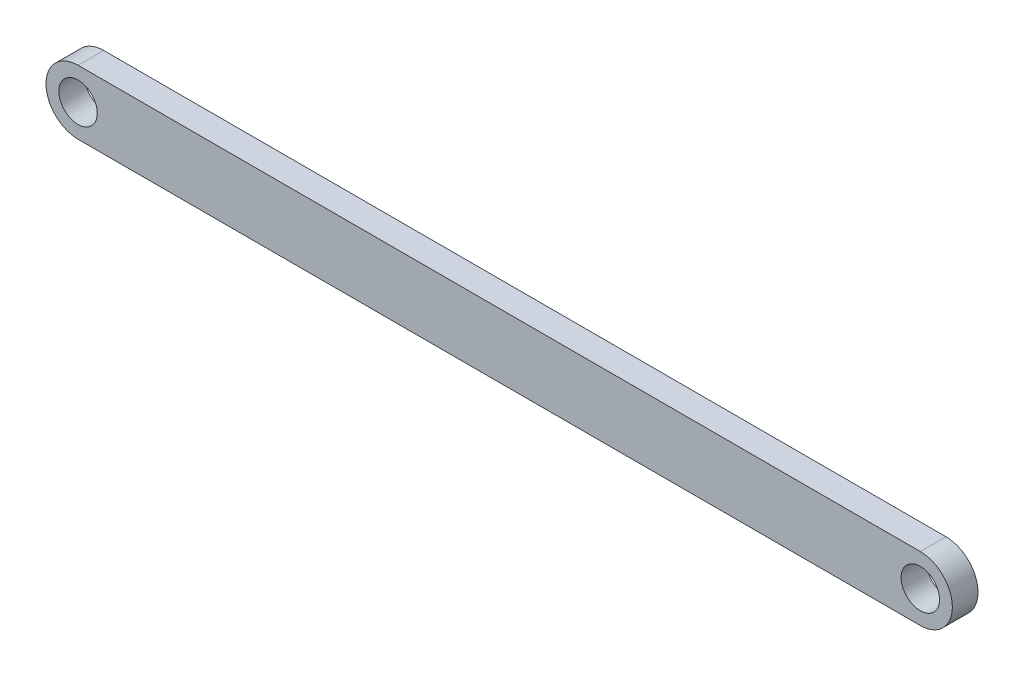
ISO-10303-21;
HEADER;
FILE_DESCRIPTION(('STEP AP214'),'2;1');
FILE_NAME('part.step','',(''),(''),'','','');
FILE_SCHEMA(('AUTOMOTIVE_DESIGN { 1 0 10303 214 1 1 1 1 }'));
ENDSEC;
DATA;
#1=APPLICATION_CONTEXT('core data for automotive mechanical design processes');
#2=APPLICATION_PROTOCOL_DEFINITION('international standard','automotive_design',2000,#1);
#3=PRODUCT_CONTEXT('',#1,'mechanical');
#4=PRODUCT('Part','Part','',(#3));
#5=PRODUCT_RELATED_PRODUCT_CATEGORY('part','',(#4));
#6=PRODUCT_DEFINITION_FORMATION('','',#4);
#7=PRODUCT_DEFINITION_CONTEXT('part definition',#1,'design');
#8=PRODUCT_DEFINITION('design','',#6,#7);
#9=PRODUCT_DEFINITION_SHAPE('','',#8);
#10=(LENGTH_UNIT() NAMED_UNIT(*) SI_UNIT(.MILLI.,.METRE.));
#11=(NAMED_UNIT(*) PLANE_ANGLE_UNIT() SI_UNIT($,.RADIAN.));
#12=(NAMED_UNIT(*) SI_UNIT($,.STERADIAN.) SOLID_ANGLE_UNIT());
#13=UNCERTAINTY_MEASURE_WITH_UNIT(LENGTH_MEASURE(1.E-05),#10,'distance_accuracy_value','');
#14=(GEOMETRIC_REPRESENTATION_CONTEXT(3) GLOBAL_UNCERTAINTY_ASSIGNED_CONTEXT((#13)) GLOBAL_UNIT_ASSIGNED_CONTEXT((#10,
#11,#12)) REPRESENTATION_CONTEXT('',''));
#15=CARTESIAN_POINT('',(0.,0.,0.));
#16=DIRECTION('',(0.,0.,1.));
#17=DIRECTION('',(1.,0.,0.));
#18=AXIS2_PLACEMENT_3D('',#15,#16,#17);
#19=CARTESIAN_POINT('',(0.0944620127087487,-0.00831713435401997,2.));
#20=DIRECTION('',(0.,0.,1.));
#21=DIRECTION('',(1.,0.,0.));
#22=AXIS2_PLACEMENT_3D('',#19,#20,#21);
#23=PLANE('',#22);
#24=CARTESIAN_POINT('',(0.0944620127087487,-0.00831713435401997,2.));
#25=DIRECTION('',(0.,0.,1.));
#26=DIRECTION('',(1.,0.,0.));
#27=AXIS2_PLACEMENT_3D('',#24,#25,#26);
#28=CIRCLE('',#27,1.5);
#29=CARTESIAN_POINT('',(1.59446201270875,-0.00831713435401997,2.));
#30=VERTEX_POINT('',#29);
#31=EDGE_CURVE('E99',#30,#30,#28,.T.);
#32=ORIENTED_EDGE('',*,*,#31,.F.);
#33=EDGE_LOOP('',(#32));
#34=FACE_BOUND('',#33,.T.);
#35=CARTESIAN_POINT('',(0.0944620127087487,-0.00831713435401997,2.));
#36=DIRECTION('',(0.,0.,1.));
#37=DIRECTION('',(1.,0.,0.));
#38=AXIS2_PLACEMENT_3D('',#35,#36,#37);
#39=CIRCLE('',#38,2.5);
#40=CARTESIAN_POINT('',(0.0944620127087487,2.49168286564598,2.));
#41=VERTEX_POINT('',#40);
#42=CARTESIAN_POINT('',(0.0944620127087487,-2.50831713435402,2.));
#43=VERTEX_POINT('',#42);
#44=EDGE_CURVE('E84',#41,#43,#39,.T.);
#45=ORIENTED_EDGE('',*,*,#44,.T.);
#46=DIRECTION('',(1.,0.,0.));
#47=VECTOR('',#46,1.);
#48=CARTESIAN_POINT('',(0.0944620127087487,-2.50831713435402,2.));
#49=LINE('',#48,#47);
#50=CARTESIAN_POINT('',(65.7944620127088,-2.50831713435402,2.));
#51=VERTEX_POINT('',#50);
#52=EDGE_CURVE('E79',#43,#51,#49,.T.);
#53=ORIENTED_EDGE('',*,*,#52,.T.);
#54=CARTESIAN_POINT('',(65.7944620127088,-0.00831713435401997,2.));
#55=DIRECTION('',(0.,0.,1.));
#56=DIRECTION('',(1.,0.,0.));
#57=AXIS2_PLACEMENT_3D('',#54,#55,#56);
#58=CIRCLE('',#57,2.5);
#59=CARTESIAN_POINT('',(65.7944620127088,2.49168286564598,2.));
#60=VERTEX_POINT('',#59);
#61=EDGE_CURVE('E82',#51,#60,#58,.T.);
#62=ORIENTED_EDGE('',*,*,#61,.T.);
#63=DIRECTION('',(-1.,0.,0.));
#64=VECTOR('',#63,1.);
#65=CARTESIAN_POINT('',(0.0944620127087487,2.49168286564598,2.));
#66=LINE('',#65,#64);
#67=EDGE_CURVE('E49',#60,#41,#66,.T.);
#68=ORIENTED_EDGE('',*,*,#67,.T.);
#69=EDGE_LOOP('',(#45,#53,#62,#68));
#70=FACE_BOUND('',#69,.T.);
#71=CARTESIAN_POINT('',(65.7944620127088,-0.00831713435401997,2.));
#72=DIRECTION('',(0.,0.,1.));
#73=DIRECTION('',(1.,0.,0.));
#74=AXIS2_PLACEMENT_3D('',#71,#72,#73);
#75=CIRCLE('',#74,1.5);
#76=CARTESIAN_POINT('',(67.2944620127088,-0.00831713435401997,2.));
#77=VERTEX_POINT('',#76);
#78=EDGE_CURVE('E114',#77,#77,#75,.T.);
#79=ORIENTED_EDGE('',*,*,#78,.F.);
#80=EDGE_LOOP('',(#79));
#81=FACE_BOUND('',#80,.T.);
#82=ADVANCED_FACE('F32',(#34,#70,#81),#23,.T.);
#83=CARTESIAN_POINT('',(0.0944620127087487,-0.00831713435401997,0.));
#84=DIRECTION('',(0.,0.,1.));
#85=DIRECTION('',(1.,0.,0.));
#86=AXIS2_PLACEMENT_3D('',#83,#84,#85);
#87=PLANE('',#86);
#88=CARTESIAN_POINT('',(0.0944620127087487,-0.00831713435401997,0.));
#89=DIRECTION('',(0.,0.,1.));
#90=DIRECTION('',(1.,0.,0.));
#91=AXIS2_PLACEMENT_3D('',#88,#89,#90);
#92=CIRCLE('',#91,2.5);
#93=CARTESIAN_POINT('',(0.0944620127087487,2.49168286564598,0.));
#94=VERTEX_POINT('',#93);
#95=CARTESIAN_POINT('',(0.0944620127087487,-2.50831713435402,0.));
#96=VERTEX_POINT('',#95);
#97=EDGE_CURVE('E96',#94,#96,#92,.T.);
#98=ORIENTED_EDGE('',*,*,#97,.F.);
#99=DIRECTION('',(-1.,0.,0.));
#100=VECTOR('',#99,1.);
#101=CARTESIAN_POINT('',(0.0944620127087487,2.49168286564598,0.));
#102=LINE('',#101,#100);
#103=CARTESIAN_POINT('',(65.7944620127088,2.49168286564598,0.));
#104=VERTEX_POINT('',#103);
#105=EDGE_CURVE('E72',#104,#94,#102,.T.);
#106=ORIENTED_EDGE('',*,*,#105,.F.);
#107=CARTESIAN_POINT('',(65.7944620127088,-0.00831713435401997,0.));
#108=DIRECTION('',(0.,0.,1.));
#109=DIRECTION('',(1.,0.,0.));
#110=AXIS2_PLACEMENT_3D('',#107,#108,#109);
#111=CIRCLE('',#110,2.5);
#112=CARTESIAN_POINT('',(65.7944620127088,-2.50831713435402,0.));
#113=VERTEX_POINT('',#112);
#114=EDGE_CURVE('E66',#113,#104,#111,.T.);
#115=ORIENTED_EDGE('',*,*,#114,.F.);
#116=DIRECTION('',(1.,0.,0.));
#117=VECTOR('',#116,1.);
#118=CARTESIAN_POINT('',(0.0944620127087487,-2.50831713435402,0.));
#119=LINE('',#118,#117);
#120=EDGE_CURVE('E88',#96,#113,#119,.T.);
#121=ORIENTED_EDGE('',*,*,#120,.F.);
#122=EDGE_LOOP('',(#98,#106,#115,#121));
#123=FACE_BOUND('',#122,.T.);
#124=CARTESIAN_POINT('',(0.0944620127087487,-0.00831713435401997,0.));
#125=DIRECTION('',(0.,0.,1.));
#126=DIRECTION('',(1.,0.,0.));
#127=AXIS2_PLACEMENT_3D('',#124,#125,#126);
#128=CIRCLE('',#127,1.5);
#129=CARTESIAN_POINT('',(1.59446201270875,-0.00831713435401997,0.));
#130=VERTEX_POINT('',#129);
#131=EDGE_CURVE('E111',#130,#130,#128,.T.);
#132=ORIENTED_EDGE('',*,*,#131,.T.);
#133=EDGE_LOOP('',(#132));
#134=FACE_BOUND('',#133,.T.);
#135=CARTESIAN_POINT('',(65.7944620127088,-0.00831713435401997,0.));
#136=DIRECTION('',(0.,0.,1.));
#137=DIRECTION('',(1.,0.,0.));
#138=AXIS2_PLACEMENT_3D('',#135,#136,#137);
#139=CIRCLE('',#138,1.5);
#140=CARTESIAN_POINT('',(67.2944620127088,-0.00831713435401997,0.));
#141=VERTEX_POINT('',#140);
#142=EDGE_CURVE('E117',#141,#141,#139,.T.);
#143=ORIENTED_EDGE('',*,*,#142,.T.);
#144=EDGE_LOOP('',(#143));
#145=FACE_BOUND('',#144,.T.);
#146=ADVANCED_FACE('F107',(#123,#134,#145),#87,.F.);
#147=CARTESIAN_POINT('',(0.0944620127087487,-0.00831713435401997,2.));
#148=DIRECTION('',(0.,0.,-1.));
#149=DIRECTION('',(-1.,0.,0.));
#150=AXIS2_PLACEMENT_3D('',#147,#148,#149);
#151=CYLINDRICAL_SURFACE('',#150,2.5);
#152=ORIENTED_EDGE('',*,*,#97,.T.);
#153=DIRECTION('',(0.,0.,-1.));
#154=VECTOR('',#153,1.);
#155=CARTESIAN_POINT('',(0.0944620127087487,-2.50831713435402,2.));
#156=LINE('',#155,#154);
#157=EDGE_CURVE('E11',#43,#96,#156,.T.);
#158=ORIENTED_EDGE('',*,*,#157,.F.);
#159=ORIENTED_EDGE('',*,*,#44,.F.);
#160=DIRECTION('',(0.,0.,-1.));
#161=VECTOR('',#160,1.);
#162=CARTESIAN_POINT('',(0.0944620127087487,2.49168286564598,2.));
#163=LINE('',#162,#161);
#164=EDGE_CURVE('E92',#41,#94,#163,.T.);
#165=ORIENTED_EDGE('',*,*,#164,.T.);
#166=EDGE_LOOP('',(#152,#158,#159,#165));
#167=FACE_BOUND('',#166,.T.);
#168=ADVANCED_FACE('F34',(#167),#151,.T.);
#169=CARTESIAN_POINT('',(0.0944620127087487,-2.50831713435402,2.));
#170=DIRECTION('',(0.,1.,0.));
#171=DIRECTION('',(0.,0.,1.));
#172=AXIS2_PLACEMENT_3D('',#169,#170,#171);
#173=PLANE('',#172);
#174=ORIENTED_EDGE('',*,*,#120,.T.);
#175=DIRECTION('',(0.,0.,-1.));
#176=VECTOR('',#175,1.);
#177=CARTESIAN_POINT('',(65.7944620127088,-2.50831713435402,2.));
#178=LINE('',#177,#176);
#179=EDGE_CURVE('E41',#51,#113,#178,.T.);
#180=ORIENTED_EDGE('',*,*,#179,.F.);
#181=ORIENTED_EDGE('',*,*,#52,.F.);
#182=ORIENTED_EDGE('',*,*,#157,.T.);
#183=EDGE_LOOP('',(#174,#180,#181,#182));
#184=FACE_BOUND('',#183,.T.);
#185=ADVANCED_FACE('F87',(#184),#173,.F.);
#186=CARTESIAN_POINT('',(65.7944620127088,-0.00831713435401997,2.));
#187=DIRECTION('',(0.,0.,-1.));
#188=DIRECTION('',(-1.,0.,0.));
#189=AXIS2_PLACEMENT_3D('',#186,#187,#188);
#190=CYLINDRICAL_SURFACE('',#189,2.5);
#191=ORIENTED_EDGE('',*,*,#114,.T.);
#192=DIRECTION('',(0.,0.,-1.));
#193=VECTOR('',#192,1.);
#194=CARTESIAN_POINT('',(65.7944620127088,2.49168286564598,2.));
#195=LINE('',#194,#193);
#196=EDGE_CURVE('E89',#60,#104,#195,.T.);
#197=ORIENTED_EDGE('',*,*,#196,.F.);
#198=ORIENTED_EDGE('',*,*,#61,.F.);
#199=ORIENTED_EDGE('',*,*,#179,.T.);
#200=EDGE_LOOP('',(#191,#197,#198,#199));
#201=FACE_BOUND('',#200,.T.);
#202=ADVANCED_FACE('F90',(#201),#190,.T.);
#203=CARTESIAN_POINT('',(0.0944620127087487,2.49168286564598,2.));
#204=DIRECTION('',(0.,-1.,0.));
#205=DIRECTION('',(0.,0.,-1.));
#206=AXIS2_PLACEMENT_3D('',#203,#204,#205);
#207=PLANE('',#206);
#208=ORIENTED_EDGE('',*,*,#105,.T.);
#209=ORIENTED_EDGE('',*,*,#164,.F.);
#210=ORIENTED_EDGE('',*,*,#67,.F.);
#211=ORIENTED_EDGE('',*,*,#196,.T.);
#212=EDGE_LOOP('',(#208,#209,#210,#211));
#213=FACE_BOUND('',#212,.T.);
#214=ADVANCED_FACE('F104',(#213),#207,.F.);
#215=CARTESIAN_POINT('',(0.0944620127087487,-0.00831713435401997,2.));
#216=DIRECTION('',(0.,0.,-1.));
#217=DIRECTION('',(-1.,0.,0.));
#218=AXIS2_PLACEMENT_3D('',#215,#216,#217);
#219=CYLINDRICAL_SURFACE('',#218,1.5);
#220=ORIENTED_EDGE('',*,*,#31,.T.);
#221=EDGE_LOOP('',(#220));
#222=FACE_BOUND('',#221,.T.);
#223=ORIENTED_EDGE('',*,*,#131,.F.);
#224=EDGE_LOOP('',(#223));
#225=FACE_BOUND('',#224,.T.);
#226=ADVANCED_FACE('F134',(#222,#225),#219,.F.);
#227=CARTESIAN_POINT('',(65.7944620127088,-0.00831713435401997,2.));
#228=DIRECTION('',(0.,0.,-1.));
#229=DIRECTION('',(-1.,0.,0.));
#230=AXIS2_PLACEMENT_3D('',#227,#228,#229);
#231=CYLINDRICAL_SURFACE('',#230,1.5);
#232=ORIENTED_EDGE('',*,*,#78,.T.);
#233=EDGE_LOOP('',(#232));
#234=FACE_BOUND('',#233,.T.);
#235=ORIENTED_EDGE('',*,*,#142,.F.);
#236=EDGE_LOOP('',(#235));
#237=FACE_BOUND('',#236,.T.);
#238=ADVANCED_FACE('F123',(#234,#237),#231,.F.);
#239=CLOSED_SHELL('',(#82,#146,#168,#185,#202,#214,#226,#238));
#240=MANIFOLD_SOLID_BREP('B2',#239);
#241=ADVANCED_BREP_SHAPE_REPRESENTATION('',(#18,#240),#14);
#242=SHAPE_DEFINITION_REPRESENTATION(#9,#241);
ENDSEC;
END-ISO-10303-21;
